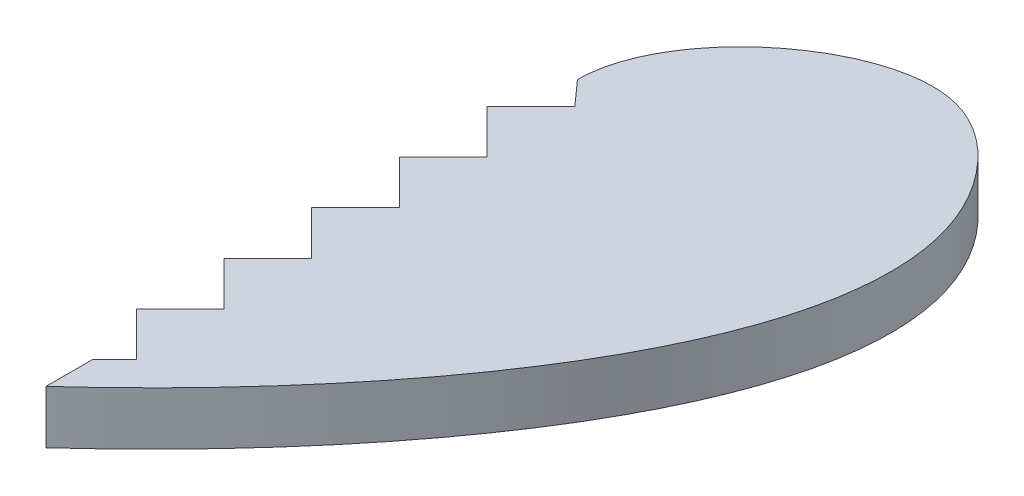
ISO-10303-21;
HEADER;
FILE_DESCRIPTION(('STEP AP214'),'2;1');
FILE_NAME('part.step','',(''),(''),'','','');
FILE_SCHEMA(('AUTOMOTIVE_DESIGN { 1 0 10303 214 1 1 1 1 }'));
ENDSEC;
DATA;
#1=APPLICATION_CONTEXT('core data for automotive mechanical design processes');
#2=APPLICATION_PROTOCOL_DEFINITION('international standard','automotive_design',2000,#1);
#3=PRODUCT_CONTEXT('',#1,'mechanical');
#4=PRODUCT('Part','Part','',(#3));
#5=PRODUCT_RELATED_PRODUCT_CATEGORY('part','',(#4));
#6=PRODUCT_DEFINITION_FORMATION('','',#4);
#7=PRODUCT_DEFINITION_CONTEXT('part definition',#1,'design');
#8=PRODUCT_DEFINITION('design','',#6,#7);
#9=PRODUCT_DEFINITION_SHAPE('','',#8);
#10=(LENGTH_UNIT() NAMED_UNIT(*) SI_UNIT(.MILLI.,.METRE.));
#11=(NAMED_UNIT(*) PLANE_ANGLE_UNIT() SI_UNIT($,.RADIAN.));
#12=(NAMED_UNIT(*) SI_UNIT($,.STERADIAN.) SOLID_ANGLE_UNIT());
#13=UNCERTAINTY_MEASURE_WITH_UNIT(LENGTH_MEASURE(1.E-05),#10,'distance_accuracy_value','');
#14=(GEOMETRIC_REPRESENTATION_CONTEXT(3) GLOBAL_UNCERTAINTY_ASSIGNED_CONTEXT((#13)) GLOBAL_UNIT_ASSIGNED_CONTEXT((#10,
#11,#12)) REPRESENTATION_CONTEXT('',''));
#15=CARTESIAN_POINT('',(0.,0.,0.));
#16=DIRECTION('',(0.,0.,1.));
#17=DIRECTION('',(1.,0.,0.));
#18=AXIS2_PLACEMENT_3D('',#15,#16,#17);
#19=CARTESIAN_POINT('',(0.,3.,15.9278555241616));
#20=CARTESIAN_POINT('',(11.5329776723601,3.,5.45462345902874));
#21=CARTESIAN_POINT('',(24.9137531388097,3.,-13.2721558044756));
#22=CARTESIAN_POINT('',(9.4205206060751,3.,-26.7563747485701));
#23=CARTESIAN_POINT('',(0.,3.,-19.24485919675));
#24=CARTESIAN_POINT('',(0.,3.,-14.0721444758384));
#25=B_SPLINE_CURVE_WITH_KNOTS('',3,(#19,#20,#21,#22,#23,#24),.UNSPECIFIED.,.F.,.F.,(4,1,1,4),
(0.,0.638332966307921,0.738332966307921,1.),.UNSPECIFIED.);
#26=DIRECTION('',(0.,-1.,0.));
#27=VECTOR('',#26,1.);
#28=SURFACE_OF_LINEAR_EXTRUSION('',#25,#27);
#29=CARTESIAN_POINT('',(0.,0.,15.9278555241616));
#30=CARTESIAN_POINT('',(11.5329776723601,0.,5.45462345902874));
#31=CARTESIAN_POINT('',(24.9137531388097,0.,-13.2721558044756));
#32=CARTESIAN_POINT('',(9.4205206060751,0.,-26.7563747485701));
#33=CARTESIAN_POINT('',(0.,0.,-19.24485919675));
#34=CARTESIAN_POINT('',(0.,0.,-14.0721444758384));
#35=B_SPLINE_CURVE_WITH_KNOTS('',3,(#29,#30,#31,#32,#33,#34),.UNSPECIFIED.,.F.,.F.,(4,1,1,4),
(0.,0.638332966307921,0.738332966307921,1.),.UNSPECIFIED.);
#36=CARTESIAN_POINT('',(0.,0.,15.9278555241616));
#37=VERTEX_POINT('',#36);
#38=CARTESIAN_POINT('',(0.,0.,-14.0721444758384));
#39=VERTEX_POINT('',#38);
#40=EDGE_CURVE('E167',#37,#39,#35,.T.);
#41=ORIENTED_EDGE('',*,*,#40,.T.);
#42=DIRECTION('',(0.,-1.,0.));
#43=VECTOR('',#42,1.);
#44=CARTESIAN_POINT('',(0.,3.,-14.0721444758384));
#45=LINE('',#44,#43);
#46=CARTESIAN_POINT('',(0.,3.,-14.0721444758384));
#47=VERTEX_POINT('',#46);
#48=EDGE_CURVE('E49',#47,#39,#45,.T.);
#49=ORIENTED_EDGE('',*,*,#48,.F.);
#50=CARTESIAN_POINT('',(0.,3.,15.9278555241616));
#51=VERTEX_POINT('',#50);
#52=EDGE_CURVE('E195',#51,#47,#25,.T.);
#53=ORIENTED_EDGE('',*,*,#52,.F.);
#54=DIRECTION('',(0.,-1.,0.));
#55=VECTOR('',#54,1.);
#56=CARTESIAN_POINT('',(0.,3.,15.9278555241616));
#57=LINE('',#56,#55);
#58=EDGE_CURVE('E11',#51,#37,#57,.T.);
#59=ORIENTED_EDGE('',*,*,#58,.T.);
#60=EDGE_LOOP('',(#41,#49,#53,#59));
#61=FACE_BOUND('',#60,.T.);
#62=ADVANCED_FACE('F40',(#61),#28,.F.);
#63=CARTESIAN_POINT('',(-18.2335204914853,3.,-13.3078582028131));
#64=DIRECTION('',(0.,-1.,0.));
#65=DIRECTION('',(0.,0.,-1.));
#66=AXIS2_PLACEMENT_3D('',#63,#64,#65);
#67=PLANE('',#66);
#68=ORIENTED_EDGE('',*,*,#52,.T.);
#69=DIRECTION('',(-0.665410411924532,0.,-0.746477718155354));
#70=VECTOR('',#69,1.);
#71=CARTESIAN_POINT('',(0.,3.,-14.0721444758384));
#72=LINE('',#71,#70);
#73=CARTESIAN_POINT('',(1.23743686707646,3.,-12.6839500136795));
#74=VERTEX_POINT('',#73);
#75=EDGE_CURVE('E76',#74,#47,#72,.T.);
#76=ORIENTED_EDGE('',*,*,#75,.F.);
#77=DIRECTION('',(0.707106781186547,0.,-0.707106781186548));
#78=VECTOR('',#77,1.);
#79=CARTESIAN_POINT('',(1.23743686707646,3.,-12.6839500136795));
#80=LINE('',#79,#78);
#81=CARTESIAN_POINT('',(-1.23743686707646,3.,-10.2090762795265));
#82=VERTEX_POINT('',#81);
#83=EDGE_CURVE('E155',#82,#74,#80,.T.);
#84=ORIENTED_EDGE('',*,*,#83,.F.);
#85=DIRECTION('',(-0.707106781186548,0.,-0.707106781186547));
#86=VECTOR('',#85,1.);
#87=CARTESIAN_POINT('',(-1.23743686707646,3.,-10.2090762795265));
#88=LINE('',#87,#86);
#89=CARTESIAN_POINT('',(1.23743686707646,3.,-7.73420254537363));
#90=VERTEX_POINT('',#89);
#91=EDGE_CURVE('E132',#90,#82,#88,.T.);
#92=ORIENTED_EDGE('',*,*,#91,.F.);
#93=DIRECTION('',(0.707106781186548,0.,-0.707106781186547));
#94=VECTOR('',#93,1.);
#95=CARTESIAN_POINT('',(1.23743686707646,3.,-7.73420254537363));
#96=LINE('',#95,#94);
#97=CARTESIAN_POINT('',(-1.23743686707646,3.,-5.25932881122071));
#98=VERTEX_POINT('',#97);
#99=EDGE_CURVE('E145',#98,#90,#96,.T.);
#100=ORIENTED_EDGE('',*,*,#99,.F.);
#101=DIRECTION('',(-0.707106781186548,0.,-0.707106781186548));
#102=VECTOR('',#101,1.);
#103=CARTESIAN_POINT('',(-1.23743686707646,3.,-5.25932881122071));
#104=LINE('',#103,#102);
#105=CARTESIAN_POINT('',(1.23743686707646,3.,-2.7844550770678));
#106=VERTEX_POINT('',#105);
#107=EDGE_CURVE('E152',#106,#98,#104,.T.);
#108=ORIENTED_EDGE('',*,*,#107,.F.);
#109=DIRECTION('',(0.707106781186547,0.,-0.707106781186547));
#110=VECTOR('',#109,1.);
#111=CARTESIAN_POINT('',(1.23743686707646,3.,-2.7844550770678));
#112=LINE('',#111,#110);
#113=CARTESIAN_POINT('',(-1.23743686707646,3.,-0.30958134291488));
#114=VERTEX_POINT('',#113);
#115=EDGE_CURVE('E285',#114,#106,#112,.T.);
#116=ORIENTED_EDGE('',*,*,#115,.F.);
#117=DIRECTION('',(-0.707106781186547,0.,-0.707106781186548));
#118=VECTOR('',#117,1.);
#119=CARTESIAN_POINT('',(-1.23743686707646,3.,-0.30958134291488));
#120=LINE('',#119,#118);
#121=CARTESIAN_POINT('',(1.23743686707646,3.,2.16529239123804));
#122=VERTEX_POINT('',#121);
#123=EDGE_CURVE('E281',#122,#114,#120,.T.);
#124=ORIENTED_EDGE('',*,*,#123,.F.);
#125=DIRECTION('',(0.707106781186547,0.,-0.707106781186548));
#126=VECTOR('',#125,1.);
#127=CARTESIAN_POINT('',(1.23743686707646,3.,2.16529239123804));
#128=LINE('',#127,#126);
#129=CARTESIAN_POINT('',(-1.23743686707646,3.,4.64016612539096));
#130=VERTEX_POINT('',#129);
#131=EDGE_CURVE('E277',#130,#122,#128,.T.);
#132=ORIENTED_EDGE('',*,*,#131,.F.);
#133=DIRECTION('',(-0.707106781186548,0.,-0.707106781186548));
#134=VECTOR('',#133,1.);
#135=CARTESIAN_POINT('',(-1.23743686707646,3.,4.64016612539096));
#136=LINE('',#135,#134);
#137=CARTESIAN_POINT('',(1.23743686707646,3.,7.11503985954387));
#138=VERTEX_POINT('',#137);
#139=EDGE_CURVE('E273',#138,#130,#136,.T.);
#140=ORIENTED_EDGE('',*,*,#139,.F.);
#141=DIRECTION('',(0.707106781186547,0.,-0.707106781186548));
#142=VECTOR('',#141,1.);
#143=CARTESIAN_POINT('',(1.23743686707646,3.,7.11503985954387));
#144=LINE('',#143,#142);
#145=CARTESIAN_POINT('',(-1.23743686707646,3.,9.58991359369679));
#146=VERTEX_POINT('',#145);
#147=EDGE_CURVE('E269',#146,#138,#144,.T.);
#148=ORIENTED_EDGE('',*,*,#147,.F.);
#149=DIRECTION('',(-0.707106781186547,0.,-0.707106781186548));
#150=VECTOR('',#149,1.);
#151=CARTESIAN_POINT('',(-1.23743686707646,3.,9.58991359369679));
#152=LINE('',#151,#150);
#153=CARTESIAN_POINT('',(1.23743686707646,3.,12.0647873278497));
#154=VERTEX_POINT('',#153);
#155=EDGE_CURVE('E265',#154,#146,#152,.T.);
#156=ORIENTED_EDGE('',*,*,#155,.F.);
#157=DIRECTION('',(0.707106781186547,0.,-0.707106781186548));
#158=VECTOR('',#157,1.);
#159=CARTESIAN_POINT('',(1.23743686707646,3.,12.0647873278497));
#160=LINE('',#159,#158);
#161=CARTESIAN_POINT('',(0.,3.,13.3022241949262));
#162=VERTEX_POINT('',#161);
#163=EDGE_CURVE('E262',#162,#154,#160,.T.);
#164=ORIENTED_EDGE('',*,*,#163,.F.);
#165=DIRECTION('',(0.,0.,-1.));
#166=VECTOR('',#165,1.);
#167=CARTESIAN_POINT('',(0.,3.,13.3022241949262));
#168=LINE('',#167,#166);
#169=EDGE_CURVE('E259',#51,#162,#168,.T.);
#170=ORIENTED_EDGE('',*,*,#169,.F.);
#171=EDGE_LOOP('',(#68,#76,#84,#92,#100,#108,#116,#124,#132,#140,#148,#156,#164,#170));
#172=FACE_BOUND('',#171,.T.);
#173=ADVANCED_FACE('F154',(#172),#67,.F.);
#174=CARTESIAN_POINT('',(-18.2335204914853,0.,-13.3078582028131));
#175=DIRECTION('',(0.,-1.,0.));
#176=DIRECTION('',(0.,0.,-1.));
#177=AXIS2_PLACEMENT_3D('',#174,#175,#176);
#178=PLANE('',#177);
#179=DIRECTION('',(-0.665410411924532,0.,-0.746477718155354));
#180=VECTOR('',#179,1.);
#181=CARTESIAN_POINT('',(0.,0.,-14.0721444758384));
#182=LINE('',#181,#180);
#183=CARTESIAN_POINT('',(1.23743686707646,0.,-12.6839500136795));
#184=VERTEX_POINT('',#183);
#185=EDGE_CURVE('E194',#184,#39,#182,.T.);
#186=ORIENTED_EDGE('',*,*,#185,.T.);
#187=ORIENTED_EDGE('',*,*,#40,.F.);
#188=DIRECTION('',(0.,0.,-1.));
#189=VECTOR('',#188,1.);
#190=CARTESIAN_POINT('',(0.,0.,13.3022241949262));
#191=LINE('',#190,#189);
#192=CARTESIAN_POINT('',(0.,0.,13.3022241949262));
#193=VERTEX_POINT('',#192);
#194=EDGE_CURVE('E164',#37,#193,#191,.T.);
#195=ORIENTED_EDGE('',*,*,#194,.T.);
#196=DIRECTION('',(0.707106781186547,0.,-0.707106781186548));
#197=VECTOR('',#196,1.);
#198=CARTESIAN_POINT('',(1.23743686707646,0.,12.0647873278497));
#199=LINE('',#198,#197);
#200=CARTESIAN_POINT('',(1.23743686707646,0.,12.0647873278497));
#201=VERTEX_POINT('',#200);
#202=EDGE_CURVE('E56',#193,#201,#199,.T.);
#203=ORIENTED_EDGE('',*,*,#202,.T.);
#204=DIRECTION('',(-0.707106781186547,0.,-0.707106781186548));
#205=VECTOR('',#204,1.);
#206=CARTESIAN_POINT('',(-1.23743686707646,0.,9.58991359369679));
#207=LINE('',#206,#205);
#208=CARTESIAN_POINT('',(-1.23743686707646,0.,9.58991359369679));
#209=VERTEX_POINT('',#208);
#210=EDGE_CURVE('E247',#201,#209,#207,.T.);
#211=ORIENTED_EDGE('',*,*,#210,.T.);
#212=DIRECTION('',(0.707106781186547,0.,-0.707106781186548));
#213=VECTOR('',#212,1.);
#214=CARTESIAN_POINT('',(1.23743686707646,0.,7.11503985954387));
#215=LINE('',#214,#213);
#216=CARTESIAN_POINT('',(1.23743686707646,0.,7.11503985954387));
#217=VERTEX_POINT('',#216);
#218=EDGE_CURVE('E243',#209,#217,#215,.T.);
#219=ORIENTED_EDGE('',*,*,#218,.T.);
#220=DIRECTION('',(-0.707106781186548,0.,-0.707106781186548));
#221=VECTOR('',#220,1.);
#222=CARTESIAN_POINT('',(-1.23743686707646,0.,4.64016612539096));
#223=LINE('',#222,#221);
#224=CARTESIAN_POINT('',(-1.23743686707646,0.,4.64016612539096));
#225=VERTEX_POINT('',#224);
#226=EDGE_CURVE('E239',#217,#225,#223,.T.);
#227=ORIENTED_EDGE('',*,*,#226,.T.);
#228=DIRECTION('',(0.707106781186547,0.,-0.707106781186548));
#229=VECTOR('',#228,1.);
#230=CARTESIAN_POINT('',(1.23743686707646,0.,2.16529239123804));
#231=LINE('',#230,#229);
#232=CARTESIAN_POINT('',(1.23743686707646,0.,2.16529239123804));
#233=VERTEX_POINT('',#232);
#234=EDGE_CURVE('E235',#225,#233,#231,.T.);
#235=ORIENTED_EDGE('',*,*,#234,.T.);
#236=DIRECTION('',(-0.707106781186547,0.,-0.707106781186548));
#237=VECTOR('',#236,1.);
#238=CARTESIAN_POINT('',(-1.23743686707646,0.,-0.30958134291488));
#239=LINE('',#238,#237);
#240=CARTESIAN_POINT('',(-1.23743686707646,0.,-0.30958134291488));
#241=VERTEX_POINT('',#240);
#242=EDGE_CURVE('E231',#233,#241,#239,.T.);
#243=ORIENTED_EDGE('',*,*,#242,.T.);
#244=DIRECTION('',(0.707106781186547,0.,-0.707106781186547));
#245=VECTOR('',#244,1.);
#246=CARTESIAN_POINT('',(1.23743686707646,0.,-2.7844550770678));
#247=LINE('',#246,#245);
#248=CARTESIAN_POINT('',(1.23743686707646,0.,-2.7844550770678));
#249=VERTEX_POINT('',#248);
#250=EDGE_CURVE('E227',#241,#249,#247,.T.);
#251=ORIENTED_EDGE('',*,*,#250,.T.);
#252=DIRECTION('',(-0.707106781186548,0.,-0.707106781186548));
#253=VECTOR('',#252,1.);
#254=CARTESIAN_POINT('',(-1.23743686707646,0.,-5.25932881122071));
#255=LINE('',#254,#253);
#256=CARTESIAN_POINT('',(-1.23743686707646,0.,-5.25932881122071));
#257=VERTEX_POINT('',#256);
#258=EDGE_CURVE('E223',#249,#257,#255,.T.);
#259=ORIENTED_EDGE('',*,*,#258,.T.);
#260=DIRECTION('',(0.707106781186548,0.,-0.707106781186547));
#261=VECTOR('',#260,1.);
#262=CARTESIAN_POINT('',(1.23743686707646,0.,-7.73420254537363));
#263=LINE('',#262,#261);
#264=CARTESIAN_POINT('',(1.23743686707646,0.,-7.73420254537363));
#265=VERTEX_POINT('',#264);
#266=EDGE_CURVE('E220',#257,#265,#263,.T.);
#267=ORIENTED_EDGE('',*,*,#266,.T.);
#268=DIRECTION('',(-0.707106781186548,0.,-0.707106781186547));
#269=VECTOR('',#268,1.);
#270=CARTESIAN_POINT('',(-1.23743686707646,0.,-10.2090762795265));
#271=LINE('',#270,#269);
#272=CARTESIAN_POINT('',(-1.23743686707646,0.,-10.2090762795265));
#273=VERTEX_POINT('',#272);
#274=EDGE_CURVE('E136',#265,#273,#271,.T.);
#275=ORIENTED_EDGE('',*,*,#274,.T.);
#276=DIRECTION('',(0.707106781186547,0.,-0.707106781186548));
#277=VECTOR('',#276,1.);
#278=CARTESIAN_POINT('',(1.23743686707646,0.,-12.6839500136795));
#279=LINE('',#278,#277);
#280=EDGE_CURVE('E214',#273,#184,#279,.T.);
#281=ORIENTED_EDGE('',*,*,#280,.T.);
#282=EDGE_LOOP('',(#186,#187,#195,#203,#211,#219,#227,#235,#243,#251,#259,#267,#275,#281));
#283=FACE_BOUND('',#282,.T.);
#284=ADVANCED_FACE('F333',(#283),#178,.T.);
#285=CARTESIAN_POINT('',(0.,0.,-14.0721444758384));
#286=DIRECTION('',(0.746477718155354,0.,-0.665410411924532));
#287=DIRECTION('',(-0.665410411924532,0.,-0.746477718155354));
#288=AXIS2_PLACEMENT_3D('',#285,#286,#287);
#289=PLANE('',#288);
#290=ORIENTED_EDGE('',*,*,#75,.T.);
#291=ORIENTED_EDGE('',*,*,#48,.T.);
#292=ORIENTED_EDGE('',*,*,#185,.F.);
#293=DIRECTION('',(0.,1.,0.));
#294=VECTOR('',#293,1.);
#295=CARTESIAN_POINT('',(1.23743686707646,0.,-12.6839500136795));
#296=LINE('',#295,#294);
#297=EDGE_CURVE('E82',#184,#74,#296,.T.);
#298=ORIENTED_EDGE('',*,*,#297,.T.);
#299=EDGE_LOOP('',(#290,#291,#292,#298));
#300=FACE_BOUND('',#299,.T.);
#301=ADVANCED_FACE('F335',(#300),#289,.F.);
#302=CARTESIAN_POINT('',(1.23743686707646,0.,-12.6839500136795));
#303=DIRECTION('',(0.707106781186548,0.,0.707106781186547));
#304=DIRECTION('',(0.707106781186547,0.,-0.707106781186548));
#305=AXIS2_PLACEMENT_3D('',#302,#303,#304);
#306=PLANE('',#305);
#307=ORIENTED_EDGE('',*,*,#83,.T.);
#308=ORIENTED_EDGE('',*,*,#297,.F.);
#309=ORIENTED_EDGE('',*,*,#280,.F.);
#310=DIRECTION('',(0.,1.,0.));
#311=VECTOR('',#310,1.);
#312=CARTESIAN_POINT('',(-1.23743686707646,0.,-10.2090762795265));
#313=LINE('',#312,#311);
#314=EDGE_CURVE('E141',#273,#82,#313,.T.);
#315=ORIENTED_EDGE('',*,*,#314,.T.);
#316=EDGE_LOOP('',(#307,#308,#309,#315));
#317=FACE_BOUND('',#316,.T.);
#318=ADVANCED_FACE('F341',(#317),#306,.F.);
#319=CARTESIAN_POINT('',(-1.23743686707646,0.,-10.2090762795265));
#320=DIRECTION('',(0.707106781186547,0.,-0.707106781186548));
#321=DIRECTION('',(-0.707106781186548,0.,-0.707106781186547));
#322=AXIS2_PLACEMENT_3D('',#319,#320,#321);
#323=PLANE('',#322);
#324=ORIENTED_EDGE('',*,*,#91,.T.);
#325=ORIENTED_EDGE('',*,*,#314,.F.);
#326=ORIENTED_EDGE('',*,*,#274,.F.);
#327=DIRECTION('',(0.,1.,0.));
#328=VECTOR('',#327,1.);
#329=CARTESIAN_POINT('',(1.23743686707646,0.,-7.73420254537363));
#330=LINE('',#329,#328);
#331=EDGE_CURVE('E127',#265,#90,#330,.T.);
#332=ORIENTED_EDGE('',*,*,#331,.T.);
#333=EDGE_LOOP('',(#324,#325,#326,#332));
#334=FACE_BOUND('',#333,.T.);
#335=ADVANCED_FACE('F129',(#334),#323,.F.);
#336=CARTESIAN_POINT('',(1.23743686707646,0.,-7.73420254537363));
#337=DIRECTION('',(0.707106781186547,0.,0.707106781186548));
#338=DIRECTION('',(0.707106781186548,0.,-0.707106781186547));
#339=AXIS2_PLACEMENT_3D('',#336,#337,#338);
#340=PLANE('',#339);
#341=ORIENTED_EDGE('',*,*,#99,.T.);
#342=ORIENTED_EDGE('',*,*,#331,.F.);
#343=ORIENTED_EDGE('',*,*,#266,.F.);
#344=DIRECTION('',(0.,1.,0.));
#345=VECTOR('',#344,1.);
#346=CARTESIAN_POINT('',(-1.23743686707646,0.,-5.25932881122071));
#347=LINE('',#346,#345);
#348=EDGE_CURVE('E142',#257,#98,#347,.T.);
#349=ORIENTED_EDGE('',*,*,#348,.T.);
#350=EDGE_LOOP('',(#341,#342,#343,#349));
#351=FACE_BOUND('',#350,.T.);
#352=ADVANCED_FACE('F146',(#351),#340,.F.);
#353=CARTESIAN_POINT('',(-1.23743686707646,0.,-5.25932881122071));
#354=DIRECTION('',(0.707106781186547,0.,-0.707106781186547));
#355=DIRECTION('',(-0.707106781186548,0.,-0.707106781186548));
#356=AXIS2_PLACEMENT_3D('',#353,#354,#355);
#357=PLANE('',#356);
#358=ORIENTED_EDGE('',*,*,#107,.T.);
#359=ORIENTED_EDGE('',*,*,#348,.F.);
#360=ORIENTED_EDGE('',*,*,#258,.F.);
#361=DIRECTION('',(0.,1.,0.));
#362=VECTOR('',#361,1.);
#363=CARTESIAN_POINT('',(1.23743686707646,0.,-2.7844550770678));
#364=LINE('',#363,#362);
#365=EDGE_CURVE('E172',#249,#106,#364,.T.);
#366=ORIENTED_EDGE('',*,*,#365,.T.);
#367=EDGE_LOOP('',(#358,#359,#360,#366));
#368=FACE_BOUND('',#367,.T.);
#369=ADVANCED_FACE('F290',(#368),#357,.F.);
#370=CARTESIAN_POINT('',(1.23743686707646,0.,-2.7844550770678));
#371=DIRECTION('',(0.707106781186548,0.,0.707106781186548));
#372=DIRECTION('',(0.707106781186548,0.,-0.707106781186548));
#373=AXIS2_PLACEMENT_3D('',#370,#371,#372);
#374=PLANE('',#373);
#375=ORIENTED_EDGE('',*,*,#115,.T.);
#376=ORIENTED_EDGE('',*,*,#365,.F.);
#377=ORIENTED_EDGE('',*,*,#250,.F.);
#378=DIRECTION('',(0.,1.,0.));
#379=VECTOR('',#378,1.);
#380=CARTESIAN_POINT('',(-1.23743686707646,0.,-0.30958134291488));
#381=LINE('',#380,#379);
#382=EDGE_CURVE('E175',#241,#114,#381,.T.);
#383=ORIENTED_EDGE('',*,*,#382,.T.);
#384=EDGE_LOOP('',(#375,#376,#377,#383));
#385=FACE_BOUND('',#384,.T.);
#386=ADVANCED_FACE('F298',(#385),#374,.F.);
#387=CARTESIAN_POINT('',(-1.23743686707646,0.,-0.30958134291488));
#388=DIRECTION('',(0.707106781186548,0.,-0.707106781186547));
#389=DIRECTION('',(-0.707106781186547,0.,-0.707106781186548));
#390=AXIS2_PLACEMENT_3D('',#387,#388,#389);
#391=PLANE('',#390);
#392=ORIENTED_EDGE('',*,*,#123,.T.);
#393=ORIENTED_EDGE('',*,*,#382,.F.);
#394=ORIENTED_EDGE('',*,*,#242,.F.);
#395=DIRECTION('',(0.,1.,0.));
#396=VECTOR('',#395,1.);
#397=CARTESIAN_POINT('',(1.23743686707646,0.,2.16529239123804));
#398=LINE('',#397,#396);
#399=EDGE_CURVE('E178',#233,#122,#398,.T.);
#400=ORIENTED_EDGE('',*,*,#399,.T.);
#401=EDGE_LOOP('',(#392,#393,#394,#400));
#402=FACE_BOUND('',#401,.T.);
#403=ADVANCED_FACE('F305',(#402),#391,.F.);
#404=CARTESIAN_POINT('',(1.23743686707646,0.,2.16529239123804));
#405=DIRECTION('',(0.707106781186548,0.,0.707106781186547));
#406=DIRECTION('',(0.707106781186547,0.,-0.707106781186548));
#407=AXIS2_PLACEMENT_3D('',#404,#405,#406);
#408=PLANE('',#407);
#409=ORIENTED_EDGE('',*,*,#131,.T.);
#410=ORIENTED_EDGE('',*,*,#399,.F.);
#411=ORIENTED_EDGE('',*,*,#234,.F.);
#412=DIRECTION('',(0.,1.,0.));
#413=VECTOR('',#412,1.);
#414=CARTESIAN_POINT('',(-1.23743686707646,0.,4.64016612539096));
#415=LINE('',#414,#413);
#416=EDGE_CURVE('E181',#225,#130,#415,.T.);
#417=ORIENTED_EDGE('',*,*,#416,.T.);
#418=EDGE_LOOP('',(#409,#410,#411,#417));
#419=FACE_BOUND('',#418,.T.);
#420=ADVANCED_FACE('F310',(#419),#408,.F.);
#421=CARTESIAN_POINT('',(-1.23743686707646,0.,4.64016612539096));
#422=DIRECTION('',(0.707106781186547,0.,-0.707106781186547));
#423=DIRECTION('',(-0.707106781186548,0.,-0.707106781186548));
#424=AXIS2_PLACEMENT_3D('',#421,#422,#423);
#425=PLANE('',#424);
#426=ORIENTED_EDGE('',*,*,#139,.T.);
#427=ORIENTED_EDGE('',*,*,#416,.F.);
#428=ORIENTED_EDGE('',*,*,#226,.F.);
#429=DIRECTION('',(0.,1.,0.));
#430=VECTOR('',#429,1.);
#431=CARTESIAN_POINT('',(1.23743686707646,0.,7.11503985954387));
#432=LINE('',#431,#430);
#433=EDGE_CURVE('E184',#217,#138,#432,.T.);
#434=ORIENTED_EDGE('',*,*,#433,.T.);
#435=EDGE_LOOP('',(#426,#427,#428,#434));
#436=FACE_BOUND('',#435,.T.);
#437=ADVANCED_FACE('F316',(#436),#425,.F.);
#438=CARTESIAN_POINT('',(1.23743686707646,0.,7.11503985954387));
#439=DIRECTION('',(0.707106781186548,0.,0.707106781186547));
#440=DIRECTION('',(0.707106781186547,0.,-0.707106781186548));
#441=AXIS2_PLACEMENT_3D('',#438,#439,#440);
#442=PLANE('',#441);
#443=ORIENTED_EDGE('',*,*,#147,.T.);
#444=ORIENTED_EDGE('',*,*,#433,.F.);
#445=ORIENTED_EDGE('',*,*,#218,.F.);
#446=DIRECTION('',(0.,1.,0.));
#447=VECTOR('',#446,1.);
#448=CARTESIAN_POINT('',(-1.23743686707646,0.,9.58991359369679));
#449=LINE('',#448,#447);
#450=EDGE_CURVE('E187',#209,#146,#449,.T.);
#451=ORIENTED_EDGE('',*,*,#450,.T.);
#452=EDGE_LOOP('',(#443,#444,#445,#451));
#453=FACE_BOUND('',#452,.T.);
#454=ADVANCED_FACE('F323',(#453),#442,.F.);
#455=CARTESIAN_POINT('',(-1.23743686707646,0.,9.58991359369679));
#456=DIRECTION('',(0.707106781186548,0.,-0.707106781186547));
#457=DIRECTION('',(-0.707106781186547,0.,-0.707106781186548));
#458=AXIS2_PLACEMENT_3D('',#455,#456,#457);
#459=PLANE('',#458);
#460=ORIENTED_EDGE('',*,*,#155,.T.);
#461=ORIENTED_EDGE('',*,*,#450,.F.);
#462=ORIENTED_EDGE('',*,*,#210,.F.);
#463=DIRECTION('',(0.,1.,0.));
#464=VECTOR('',#463,1.);
#465=CARTESIAN_POINT('',(1.23743686707646,0.,12.0647873278497));
#466=LINE('',#465,#464);
#467=EDGE_CURVE('E190',#201,#154,#466,.T.);
#468=ORIENTED_EDGE('',*,*,#467,.T.);
#469=EDGE_LOOP('',(#460,#461,#462,#468));
#470=FACE_BOUND('',#469,.T.);
#471=ADVANCED_FACE('F328',(#470),#459,.F.);
#472=CARTESIAN_POINT('',(1.23743686707646,0.,12.0647873278497));
#473=DIRECTION('',(0.707106781186548,0.,0.707106781186547));
#474=DIRECTION('',(0.707106781186547,0.,-0.707106781186548));
#475=AXIS2_PLACEMENT_3D('',#472,#473,#474);
#476=PLANE('',#475);
#477=ORIENTED_EDGE('',*,*,#163,.T.);
#478=ORIENTED_EDGE('',*,*,#467,.F.);
#479=ORIENTED_EDGE('',*,*,#202,.F.);
#480=DIRECTION('',(0.,1.,0.));
#481=VECTOR('',#480,1.);
#482=CARTESIAN_POINT('',(0.,0.,13.3022241949262));
#483=LINE('',#482,#481);
#484=EDGE_CURVE('E97',#193,#162,#483,.T.);
#485=ORIENTED_EDGE('',*,*,#484,.T.);
#486=EDGE_LOOP('',(#477,#478,#479,#485));
#487=FACE_BOUND('',#486,.T.);
#488=ADVANCED_FACE('F331',(#487),#476,.F.);
#489=CARTESIAN_POINT('',(0.,0.,13.3022241949262));
#490=DIRECTION('',(1.,0.,0.));
#491=DIRECTION('',(0.,0.,-1.));
#492=AXIS2_PLACEMENT_3D('',#489,#490,#491);
#493=PLANE('',#492);
#494=ORIENTED_EDGE('',*,*,#169,.T.);
#495=ORIENTED_EDGE('',*,*,#484,.F.);
#496=ORIENTED_EDGE('',*,*,#194,.F.);
#497=ORIENTED_EDGE('',*,*,#58,.F.);
#498=EDGE_LOOP('',(#494,#495,#496,#497));
#499=FACE_BOUND('',#498,.T.);
#500=ADVANCED_FACE('F428',(#499),#493,.F.);
#501=CLOSED_SHELL('',(#62,#173,#284,#301,#318,#335,#352,#369,#386,#403,#420,#437,#454,#471,#488,#500));
#502=MANIFOLD_SOLID_BREP('B2',#501);
#503=ADVANCED_BREP_SHAPE_REPRESENTATION('',(#18,#502),#14);
#504=SHAPE_DEFINITION_REPRESENTATION(#9,#503);
ENDSEC;
END-ISO-10303-21;
